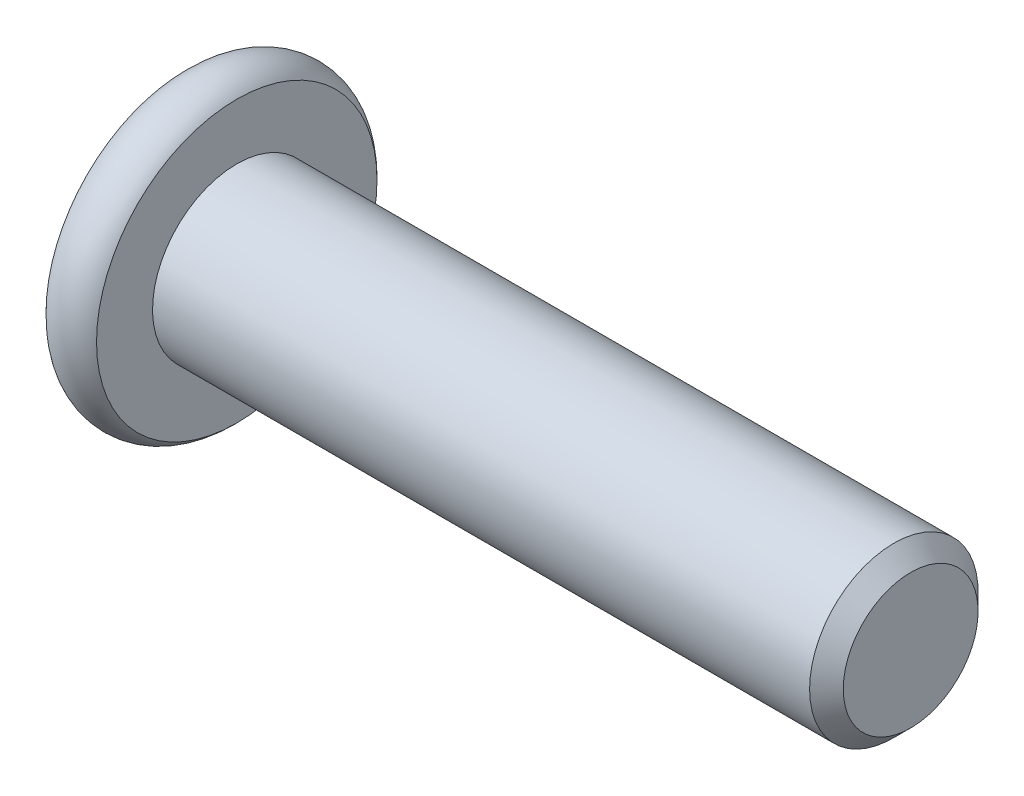
ISO-10303-21;
HEADER;
FILE_DESCRIPTION(('STEP AP214'),'2;1');
FILE_NAME('part.step','',(''),(''),'','','');
FILE_SCHEMA(('AUTOMOTIVE_DESIGN { 1 0 10303 214 1 1 1 1 }'));
ENDSEC;
DATA;
#1=APPLICATION_CONTEXT('core data for automotive mechanical design processes');
#2=APPLICATION_PROTOCOL_DEFINITION('international standard','automotive_design',2000,#1);
#3=PRODUCT_CONTEXT('',#1,'mechanical');
#4=PRODUCT('Part','Part','',(#3));
#5=PRODUCT_RELATED_PRODUCT_CATEGORY('part','',(#4));
#6=PRODUCT_DEFINITION_FORMATION('','',#4);
#7=PRODUCT_DEFINITION_CONTEXT('part definition',#1,'design');
#8=PRODUCT_DEFINITION('design','',#6,#7);
#9=PRODUCT_DEFINITION_SHAPE('','',#8);
#10=(LENGTH_UNIT() NAMED_UNIT(*) SI_UNIT(.MILLI.,.METRE.));
#11=(NAMED_UNIT(*) PLANE_ANGLE_UNIT() SI_UNIT($,.RADIAN.));
#12=(NAMED_UNIT(*) SI_UNIT($,.STERADIAN.) SOLID_ANGLE_UNIT());
#13=UNCERTAINTY_MEASURE_WITH_UNIT(LENGTH_MEASURE(1.E-05),#10,'distance_accuracy_value','');
#14=(GEOMETRIC_REPRESENTATION_CONTEXT(3) GLOBAL_UNCERTAINTY_ASSIGNED_CONTEXT((#13)) GLOBAL_UNIT_ASSIGNED_CONTEXT((#10,
#11,#12)) REPRESENTATION_CONTEXT('',''));
#15=CARTESIAN_POINT('',(0.,0.,0.));
#16=DIRECTION('',(0.,0.,1.));
#17=DIRECTION('',(1.,0.,0.));
#18=AXIS2_PLACEMENT_3D('',#15,#16,#17);
#19=CARTESIAN_POINT('',(-19.2,1.11022302462516E-13,2.22044604925031E-13));
#20=DIRECTION('',(-1.,0.,0.));
#21=DIRECTION('',(0.,-1.,0.));
#22=AXIS2_PLACEMENT_3D('',#19,#20,#21);
#23=PLANE('',#22);
#24=DIRECTION('',(0.,-0.5,-0.866025403784439));
#25=VECTOR('',#24,1.);
#26=CARTESIAN_POINT('',(-19.2,-1.732050807569,4.44089209850063E-13));
#27=LINE('',#26,#25);
#28=CARTESIAN_POINT('',(-19.2,-1.73205080756905,4.12227544476185E-13));
#29=VERTEX_POINT('',#28);
#30=CARTESIAN_POINT('',(-19.2,-0.866025403784579,1.50000000000029));
#31=VERTEX_POINT('',#30);
#32=EDGE_CURVE('E105',#29,#31,#27,.F.);
#33=ORIENTED_EDGE('',*,*,#32,.T.);
#34=DIRECTION('',(0.,-1.,0.));
#35=VECTOR('',#34,1.);
#36=CARTESIAN_POINT('',(-19.2,-0.866025403784554,1.50000000000028));
#37=LINE('',#36,#35);
#38=CARTESIAN_POINT('',(-19.2,0.866025403784387,1.5000000000002));
#39=VERTEX_POINT('',#38);
#40=EDGE_CURVE('E122',#31,#39,#37,.F.);
#41=ORIENTED_EDGE('',*,*,#40,.T.);
#42=DIRECTION('',(0.,-0.5,0.866025403784439));
#43=VECTOR('',#42,1.);
#44=CARTESIAN_POINT('',(-19.2,0.866025403784387,1.50000000000017));
#45=LINE('',#44,#43);
#46=CARTESIAN_POINT('',(-19.2,1.73205080756891,0.));
#47=VERTEX_POINT('',#46);
#48=EDGE_CURVE('E73',#39,#47,#45,.F.);
#49=ORIENTED_EDGE('',*,*,#48,.T.);
#50=DIRECTION('',(0.,0.5,0.866025403784439));
#51=VECTOR('',#50,1.);
#52=CARTESIAN_POINT('',(-19.2,1.73205080756889,0.));
#53=LINE('',#52,#51);
#54=CARTESIAN_POINT('',(-19.2,0.866025403784346,-1.50000000000017));
#55=VERTEX_POINT('',#54);
#56=EDGE_CURVE('E87',#47,#55,#53,.F.);
#57=ORIENTED_EDGE('',*,*,#56,.T.);
#58=DIRECTION('',(0.,1.,0.));
#59=VECTOR('',#58,1.);
#60=CARTESIAN_POINT('',(-19.2,0.866025403784332,-1.50000000000017));
#61=LINE('',#60,#59);
#62=CARTESIAN_POINT('',(-19.2,-0.866025403784554,-1.50000000000002));
#63=VERTEX_POINT('',#62);
#64=EDGE_CURVE('E89',#55,#63,#61,.F.);
#65=ORIENTED_EDGE('',*,*,#64,.T.);
#66=DIRECTION('',(0.,0.5,-0.866025403784439));
#67=VECTOR('',#66,1.);
#68=CARTESIAN_POINT('',(-19.2,-0.866025403784554,-1.49999999999995));
#69=LINE('',#68,#67);
#70=EDGE_CURVE('E98',#63,#29,#69,.F.);
#71=ORIENTED_EDGE('',*,*,#70,.T.);
#72=EDGE_LOOP('',(#33,#41,#49,#57,#65,#71));
#73=FACE_BOUND('',#72,.T.);
#74=ADVANCED_FACE('F16',(#73),#23,.T.);
#75=CARTESIAN_POINT('',(-19.2,0.866025403784332,-1.50000000000017));
#76=DIRECTION('',(0.,0.,-1.));
#77=DIRECTION('',(0.,1.,0.));
#78=AXIS2_PLACEMENT_3D('',#75,#76,#77);
#79=PLANE('',#78);
#80=CARTESIAN_POINT('',(-21.4499999646885,0.866025333005009,-1.50000000000348));
#81=CARTESIAN_POINT('',(-21.4202628181792,0.806493904918047,-1.50000000000136));
#82=CARTESIAN_POINT('',(-21.3922724728056,0.745967110481277,-1.50000000000049));
#83=CARTESIAN_POINT('',(-21.3410233456331,0.622546765476727,-1.49999999999985));
#84=CARTESIAN_POINT('',(-21.317793069509,0.559641484044933,-1.50000000000008));
#85=CARTESIAN_POINT('',(-21.2779994505405,0.432796069034418,-1.50000000000025));
#86=CARTESIAN_POINT('',(-21.2613361149431,0.368888221746386,-1.50000000000019));
#87=CARTESIAN_POINT('',(-21.2356630722141,0.239665989378908,-1.50000000000015));
#88=CARTESIAN_POINT('',(-21.226634208317,0.174355549007323,-1.50000000000016));
#89=CARTESIAN_POINT('',(-21.2184874102268,0.0617869427827018,-1.50000000000017));
#90=CARTESIAN_POINT('',(-21.2172818824174,0.0146740817378056,-1.50000000000017));
#91=CARTESIAN_POINT('',(-21.2193161388826,-0.0794684187308703,-1.50000000000017));
#92=CARTESIAN_POINT('',(-21.2225569051143,-0.126498037473702,-1.50000000000017));
#93=CARTESIAN_POINT('',(-21.2332973069677,-0.22010433346858,-1.50000000000017));
#94=CARTESIAN_POINT('',(-21.2408009028577,-0.266680548513968,-1.50000000000017));
#95=CARTESIAN_POINT('',(-21.2596594760416,-0.359051196505823,-1.50000000000017));
#96=CARTESIAN_POINT('',(-21.2710161059492,-0.404845285121393,-1.50000000000017));
#97=CARTESIAN_POINT('',(-21.3047185804914,-0.52209769377422,-1.50000000000017));
#98=CARTESIAN_POINT('',(-21.3296009771679,-0.592830026999191,-1.50000000000017));
#99=CARTESIAN_POINT('',(-21.3716037140561,-0.696834151520759,-1.50000000000017));
#100=CARTESIAN_POINT('',(-21.3863606345896,-0.731106739416639,-1.50000000000017));
#101=CARTESIAN_POINT('',(-21.4172215007328,-0.799021963429262,-1.50000000000017));
#102=CARTESIAN_POINT('',(-21.4333248053878,-0.832664890069435,-1.50000000000017));
#103=CARTESIAN_POINT('',(-21.4499999647041,-0.866025333032227,-1.50000000000017));
#104=B_SPLINE_CURVE_WITH_KNOTS('',3,(#80,#81,#82,#83,#84,#85,#86,#87,#88,#89,#90,#91,#92,#93,
#94,#95,#96,#97,#98,#99,#100,#101,#102,#103),.UNSPECIFIED.,.F.,.F.,(4,2,2,2,2,2,2,2,2,2,2,4),
(0.,0.199774403103241,0.400712278287902,0.598459940053955,0.795709919291978,0.93689462376089,
1.07811051367086,1.21945781148113,1.36086581168796,1.58533898614379,1.69726351134722,
1.8091350542896),.UNSPECIFIED.);
#105=CARTESIAN_POINT('',(-21.4500000036056,0.86602540025868,-1.50000000610682));
#106=VERTEX_POINT('',#105);
#107=CARTESIAN_POINT('',(-21.4499999823918,-0.866025368407813,-1.50000000000005));
#108=VERTEX_POINT('',#107);
#109=EDGE_CURVE('E19',#106,#108,#104,.T.);
#110=ORIENTED_EDGE('',*,*,#109,.T.);
#111=DIRECTION('',(1.,0.,0.));
#112=VECTOR('',#111,1.);
#113=CARTESIAN_POINT('',(-19.2,-0.866025403784554,-1.49999999999995));
#114=LINE('',#113,#112);
#115=EDGE_CURVE('E92',#108,#63,#114,.T.);
#116=ORIENTED_EDGE('',*,*,#115,.T.);
#117=ORIENTED_EDGE('',*,*,#64,.F.);
#118=DIRECTION('',(1.,0.,0.));
#119=VECTOR('',#118,1.);
#120=CARTESIAN_POINT('',(-19.2,0.866025403784346,-1.50000000000018));
#121=LINE('',#120,#119);
#122=EDGE_CURVE('E62',#55,#106,#121,.F.);
#123=ORIENTED_EDGE('',*,*,#122,.T.);
#124=EDGE_LOOP('',(#110,#116,#117,#123));
#125=FACE_BOUND('',#124,.T.);
#126=ADVANCED_FACE('F94',(#125),#79,.F.);
#127=CARTESIAN_POINT('',(-19.2,-0.866025403784554,-1.49999999999995));
#128=DIRECTION('',(0.,-0.866025403784439,-0.5));
#129=DIRECTION('',(0.,0.5,-0.866025403784439));
#130=AXIS2_PLACEMENT_3D('',#127,#128,#129);
#131=PLANE('',#130);
#132=CARTESIAN_POINT('',(-21.4500000205659,-0.866025373568964,-1.4999999911101));
#133=CARTESIAN_POINT('',(-21.4202628611323,-0.895791104607932,-1.44844427182069));
#134=CARTESIAN_POINT('',(-21.3922725080009,-0.92605451005725,-1.39602653208729));
#135=CARTESIAN_POINT('',(-21.3410233701714,-0.987764691357992,-1.28914137459533));
#136=CARTESIAN_POINT('',(-21.3177930911687,-1.01921733259522,-1.23466379757139));
#137=CARTESIAN_POINT('',(-21.2779994659171,-1.08264004325779,-1.12481243721317));
#138=CARTESIAN_POINT('',(-21.2613361268894,-1.11459396949522,-1.06946661461272));
#139=CARTESIAN_POINT('',(-21.2356630784661,-1.17920509052607,-0.957556871075898));
#140=CARTESIAN_POINT('',(-21.2266342123071,-1.21186031296697,-0.900996366357963));
#141=CARTESIAN_POINT('',(-21.2184874115618,-1.26814461833851,-0.803509089626276));
#142=CARTESIAN_POINT('',(-21.2172818827387,-1.29170104877942,-0.762708155306338));
#143=CARTESIAN_POINT('',(-21.2193161371708,-1.33877229887107,-0.681178358607479));
#144=CARTESIAN_POINT('',(-21.222556902382,-1.36228710818135,-0.640449514138743));
#145=CARTESIAN_POINT('',(-21.2332973022396,-1.40909025614153,-0.559384083907977));
#146=CARTESIAN_POINT('',(-21.2408008971605,-1.43237836368778,-0.519047898429233));
#147=CARTESIAN_POINT('',(-21.2596594685009,-1.47856368775851,-0.43905257057729));
#148=CARTESIAN_POINT('',(-21.2710160975342,-1.50146073211755,-0.399393726403392));
#149=CARTESIAN_POINT('',(-21.304718575203,-1.56008694571787,-0.297850145791179));
#150=CARTESIAN_POINT('',(-21.3296009780989,-1.59545312126237,-0.236594132879223));
#151=CARTESIAN_POINT('',(-21.3716037265078,-1.6474551963868,-0.146523896664901));
#152=CARTESIAN_POINT('',(-21.3863606512358,-1.6645914945245,-0.116842957636725));
#153=CARTESIAN_POINT('',(-21.4172215263397,-1.69854911474959,-0.0580266341026783));
#154=CARTESIAN_POINT('',(-21.4333248357597,-1.71537058209897,-0.0288909979956472));
#155=CARTESIAN_POINT('',(-21.4500000000594,-1.73205080754814,-3.60527799728126E-11));
#156=B_SPLINE_CURVE_WITH_KNOTS('',3,(#132,#133,#134,#135,#136,#137,#138,#139,#140,#141,#142,
#143,#144,#145,#146,#147,#148,#149,#150,#151,#152,#153,#154,#155),.UNSPECIFIED.,.F.,.F.,(4,2,2,
2,2,2,2,2,2,2,2,4),(0.,0.199774419630154,0.400712311126413,0.598459987770823,0.795709981982896,
0.936894685933899,1.07811057529518,1.21945787276772,1.36086587264047,1.58533910346246,
1.69726365672268,1.80913522763079),.UNSPECIFIED.);
#157=CARTESIAN_POINT('',(-21.4499999999911,-1.73205080753866,3.30321687967426E-13));
#158=VERTEX_POINT('',#157);
#159=EDGE_CURVE('E193',#108,#158,#156,.T.);
#160=ORIENTED_EDGE('',*,*,#159,.T.);
#161=DIRECTION('',(1.,0.,0.));
#162=VECTOR('',#161,1.);
#163=CARTESIAN_POINT('',(-19.2,-1.732050807569,4.44116400375182E-13));
#164=LINE('',#163,#162);
#165=EDGE_CURVE('E110',#158,#29,#164,.T.);
#166=ORIENTED_EDGE('',*,*,#165,.T.);
#167=ORIENTED_EDGE('',*,*,#70,.F.);
#168=ORIENTED_EDGE('',*,*,#115,.F.);
#169=EDGE_LOOP('',(#160,#166,#167,#168));
#170=FACE_BOUND('',#169,.T.);
#171=ADVANCED_FACE('F199',(#170),#131,.F.);
#172=CARTESIAN_POINT('',(-19.2,1.73205080756889,0.));
#173=DIRECTION('',(0.,0.866025403784439,-0.5));
#174=DIRECTION('',(0.,0.5,0.866025403784439));
#175=AXIS2_PLACEMENT_3D('',#172,#173,#174);
#176=PLANE('',#175);
#177=CARTESIAN_POINT('',(-21.4500000000603,1.73205080753914,-3.70697593604407E-11));
#178=CARTESIAN_POINT('',(-21.4202628496066,1.70228509136382,-0.0515557327856642));
#179=CARTESIAN_POINT('',(-21.3922725003558,1.67202169195343,-0.103973478178008));
#180=CARTESIAN_POINT('',(-21.3410233657898,1.61031151485385,-0.210858640261363));
#181=CARTESIAN_POINT('',(-21.3177930861585,1.57885887173032,-0.265336216182613));
#182=CARTESIAN_POINT('',(-21.2779994610234,1.51543615935823,-0.375187576364152));
#183=CARTESIAN_POINT('',(-21.261336122734,1.48348223326158,-0.430533399865125));
#184=CARTESIAN_POINT('',(-21.2356630756987,1.41887111201441,-0.542443144599422));
#185=CARTESIAN_POINT('',(-21.22663421018,1.38621588921876,-0.599003649613897));
#186=CARTESIAN_POINT('',(-21.2184874107391,1.32993158336417,-0.696490927022741));
#187=CARTESIAN_POINT('',(-21.2172818825308,1.30637515274063,-0.737291861707695));
#188=CARTESIAN_POINT('',(-21.219316138243,1.25930390228714,-0.818821659068949));
#189=CARTESIAN_POINT('',(-21.2225569041202,1.23578909279766,-0.859550503835035));
#190=CARTESIAN_POINT('',(-21.2332973053319,1.18898594453939,-0.94061593457253));
#191=CARTESIAN_POINT('',(-21.2408009009368,1.16569783687405,-0.980952120261031));
#192=CARTESIAN_POINT('',(-21.2596594736259,1.11951251258741,-1.06094744848954));
#193=CARTESIAN_POINT('',(-21.2710161033238,1.09661546813158,-1.10060629283021));
#194=CARTESIAN_POINT('',(-21.3047185820239,1.03798925540975,-1.20214987191976));
#195=CARTESIAN_POINT('',(-21.3296009849972,1.0026230808166,-1.26340588318445));
#196=CARTESIAN_POINT('',(-21.3716037331999,0.950621007047378,-1.35347611705168));
#197=CARTESIAN_POINT('',(-21.3863606578141,0.93348470934078,-1.38315705533313));
#198=CARTESIAN_POINT('',(-21.4172215326024,0.899527089960107,-1.44197337740455));
#199=CARTESIAN_POINT('',(-21.4333248418208,0.882705623024075,-1.47110901279559));
#200=CARTESIAN_POINT('',(-21.4500000058833,0.866025397981074,-1.50000001005175));
#201=B_SPLINE_CURVE_WITH_KNOTS('',3,(#177,#178,#179,#180,#181,#182,#183,#184,#185,#186,#187,
#188,#189,#190,#191,#192,#193,#194,#195,#196,#197,#198,#199,#200),.UNSPECIFIED.,.F.,.F.,(4,2,2,
2,2,2,2,2,2,2,2,4),(0.,0.199774419892707,0.400712312242308,0.5984599902201,0.795709985507776,
0.936894690613793,1.07811058115291,1.21945787966601,1.36086588058242,1.5853391061546,
1.69726365690588,1.80913522531795),.UNSPECIFIED.);
#202=CARTESIAN_POINT('',(-21.4500000000447,1.7320508075386,0.));
#203=VERTEX_POINT('',#202);
#204=EDGE_CURVE('E102',#203,#106,#201,.T.);
#205=ORIENTED_EDGE('',*,*,#204,.T.);
#206=ORIENTED_EDGE('',*,*,#122,.F.);
#207=ORIENTED_EDGE('',*,*,#56,.F.);
#208=DIRECTION('',(1.,0.,0.));
#209=VECTOR('',#208,1.);
#210=CARTESIAN_POINT('',(-19.2,1.73205080756891,0.));
#211=LINE('',#210,#209);
#212=EDGE_CURVE('E43',#47,#203,#211,.F.);
#213=ORIENTED_EDGE('',*,*,#212,.T.);
#214=EDGE_LOOP('',(#205,#206,#207,#213));
#215=FACE_BOUND('',#214,.T.);
#216=ADVANCED_FACE('F100',(#215),#176,.F.);
#217=CARTESIAN_POINT('',(-19.2,-1.732050807569,4.44089209850063E-13));
#218=DIRECTION('',(0.,-0.866025403784439,0.5));
#219=DIRECTION('',(0.,-0.5,-0.866025403784439));
#220=AXIS2_PLACEMENT_3D('',#217,#218,#219);
#221=PLANE('',#220);
#222=CARTESIAN_POINT('',(-21.4500000000593,-1.73205080754833,3.65670650555271E-11));
#223=CARTESIAN_POINT('',(-21.4202628496423,-1.70228509140311,0.0515557327235319));
#224=CARTESIAN_POINT('',(-21.3922725004231,-1.6720216920269,0.103973478052801));
#225=CARTESIAN_POINT('',(-21.3410233659059,-1.61031151500032,0.210858640006839));
#226=CARTESIAN_POINT('',(-21.3177930862918,-1.57885887191565,0.265336215861846));
#227=CARTESIAN_POINT('',(-21.2779994611265,-1.51543615954775,0.375187576036891));
#228=CARTESIAN_POINT('',(-21.2613361228043,-1.48348223341406,0.430533399601733));
#229=CARTESIAN_POINT('',(-21.2356630757205,-1.41887111209099,0.542443144467291));
#230=CARTESIAN_POINT('',(-21.2266342101859,-1.38621588925648,0.599003649549134));
#231=CARTESIAN_POINT('',(-21.2184874107375,-1.32993158334896,0.696490927049709));
#232=CARTESIAN_POINT('',(-21.21728188253,-1.3063751527116,0.737291861758592));
#233=CARTESIAN_POINT('',(-21.2193161382487,-1.2593039022304,0.818821659167839));
#234=CARTESIAN_POINT('',(-21.2225569041319,-1.23578909272702,0.859550503957987));
#235=CARTESIAN_POINT('',(-21.2332973053539,-1.18898594446873,0.940615934695531));
#236=CARTESIAN_POINT('',(-21.2408009009582,-1.16569783681697,0.980952120360514));
#237=CARTESIAN_POINT('',(-21.2596594736414,-1.1195125125574,1.06094744854212));
#238=CARTESIAN_POINT('',(-21.2710161033338,-1.09661546811505,1.10060629285945));
#239=CARTESIAN_POINT('',(-21.3047185777738,-1.03798926280439,1.20214985911248));
#240=CARTESIAN_POINT('',(-21.3296009747641,-1.00262309536351,1.26340585798906));
#241=CARTESIAN_POINT('',(-21.3716037123773,-0.950621031890471,1.35347607402279));
#242=CARTESIAN_POINT('',(-21.3863606332032,-0.933484737535388,1.38315700649925));
#243=CARTESIAN_POINT('',(-21.4172214999976,-0.89952712473064,1.44197331718082));
#244=CARTESIAN_POINT('',(-21.4333248050113,-0.882705661019233,1.47110894698666));
#245=CARTESIAN_POINT('',(-21.4499999647122,-0.866025439152865,1.49999993874073));
#246=B_SPLINE_CURVE_WITH_KNOTS('',3,(#222,#223,#224,#225,#226,#227,#228,#229,#230,#231,#232,
#233,#234,#235,#236,#237,#238,#239,#240,#241,#242,#243,#244,#245),.UNSPECIFIED.,.F.,.F.,(4,2,2,
2,2,2,2,2,2,2,2,4),(0.,0.199774419659113,0.400712311775826,0.598459989991556,0.795709985514906,
0.936894690703464,1.07811058132635,1.21945787975995,1.36086588059107,1.58533906000743,
1.69726358780022,1.80913513332332),.UNSPECIFIED.);
#247=CARTESIAN_POINT('',(-21.4499999823961,-0.866025421468877,1.49999996937021));
#248=VERTEX_POINT('',#247);
#249=EDGE_CURVE('E267',#158,#248,#246,.T.);
#250=ORIENTED_EDGE('',*,*,#249,.T.);
#251=DIRECTION('',(1.,0.,0.));
#252=VECTOR('',#251,1.);
#253=CARTESIAN_POINT('',(-19.2,-0.866025403784554,1.50000000000028));
#254=LINE('',#253,#252);
#255=EDGE_CURVE('E125',#248,#31,#254,.T.);
#256=ORIENTED_EDGE('',*,*,#255,.T.);
#257=ORIENTED_EDGE('',*,*,#32,.F.);
#258=ORIENTED_EDGE('',*,*,#165,.F.);
#259=EDGE_LOOP('',(#250,#256,#257,#258));
#260=FACE_BOUND('',#259,.T.);
#261=ADVANCED_FACE('F261',(#260),#221,.F.);
#262=CARTESIAN_POINT('',(-19.2,-0.866025403784554,1.50000000000028));
#263=DIRECTION('',(0.,0.,1.));
#264=DIRECTION('',(0.,-1.,0.));
#265=AXIS2_PLACEMENT_3D('',#262,#263,#264);
#266=PLANE('',#265);
#267=CARTESIAN_POINT('',(-21.4500000205553,-0.866025411178203,1.49999996939382));
#268=CARTESIAN_POINT('',(-21.4202628611542,-0.806493983103668,1.49999998898728));
#269=CARTESIAN_POINT('',(-21.3922725080508,-0.745967186223708,1.49999999704316));
#270=CARTESIAN_POINT('',(-21.3410233702652,-0.622546834027802,1.50000000297462));
#271=CARTESIAN_POINT('',(-21.3177930912783,-0.559641547837078,1.50000000079063));
#272=CARTESIAN_POINT('',(-21.2779994660023,-0.432796123804603,1.49999999922248));
#273=CARTESIAN_POINT('',(-21.2613361269473,-0.368888272258535,1.49999999979441));
#274=CARTESIAN_POINT('',(-21.2356630784834,-0.239666030781878,1.50000000020563));
#275=CARTESIAN_POINT('',(-21.2266342123112,-0.174355585559518,1.50000000004674));
#276=CARTESIAN_POINT('',(-21.2184874115599,-0.0617869745889716,1.49999999996702));
#277=CARTESIAN_POINT('',(-21.2172818827375,-0.0146741137256615,1.49999999999137));
#278=CARTESIAN_POINT('',(-21.2193161371755,0.079468386474166,1.50000000000919));
#279=CARTESIAN_POINT('',(-21.2225569023919,0.126498005129778,1.50000000000267));
#280=CARTESIAN_POINT('',(-21.2332973022584,0.220104301058296,1.49999999999788));
#281=CARTESIAN_POINT('',(-21.2408008971788,0.266680516124372,1.49999999999963));
#282=CARTESIAN_POINT('',(-21.2596594685143,0.359051164216919,1.50000000000093));
#283=CARTESIAN_POINT('',(-21.271016097543,0.404845252912526,1.50000000000049));
#284=CARTESIAN_POINT('',(-21.3047185715542,0.522097667387475,1.49999999999995));
#285=CARTESIAN_POINT('',(-21.3296009693131,0.592830006194069,1.50000000000021));
#286=CARTESIAN_POINT('',(-21.3716037086299,0.696834138762038,1.50000000000031));
#287=CARTESIAN_POINT('',(-21.3863606301052,0.731106729282198,1.5000000000003));
#288=CARTESIAN_POINT('',(-21.4172214983456,0.799021958440166,1.50000000000026));
#289=CARTESIAN_POINT('',(-21.4333248041555,0.8326648876016,1.50000000000025));
#290=CARTESIAN_POINT('',(-21.4499999647103,0.86602533304492,1.50000000000028));
#291=B_SPLINE_CURVE_WITH_KNOTS('',3,(#267,#268,#269,#270,#271,#272,#273,#274,#275,#276,#277,
#278,#279,#280,#281,#282,#283,#284,#285,#286,#287,#288,#289,#290),.UNSPECIFIED.,.F.,.F.,(4,2,2,
2,2,2,2,2,2,2,2,4),(0.,0.199774419425052,0.400712310716702,0.598459987560867,0.795709981970799,
0.936894685992416,1.07811057542538,1.21945787282943,1.36086587262872,1.58533906382119,
1.69726359736914,1.80913514862467),.UNSPECIFIED.);
#292=CARTESIAN_POINT('',(-21.449999982395,0.866025368414274,1.50000000000023));
#293=VERTEX_POINT('',#292);
#294=EDGE_CURVE('E168',#248,#293,#291,.T.);
#295=ORIENTED_EDGE('',*,*,#294,.T.);
#296=DIRECTION('',(1.,0.,0.));
#297=VECTOR('',#296,1.);
#298=CARTESIAN_POINT('',(-19.2,0.866025403784387,1.50000000000017));
#299=LINE('',#298,#297);
#300=EDGE_CURVE('E237',#293,#39,#299,.T.);
#301=ORIENTED_EDGE('',*,*,#300,.T.);
#302=ORIENTED_EDGE('',*,*,#40,.F.);
#303=ORIENTED_EDGE('',*,*,#255,.F.);
#304=EDGE_LOOP('',(#295,#301,#302,#303));
#305=FACE_BOUND('',#304,.T.);
#306=ADVANCED_FACE('F270',(#305),#266,.F.);
#307=CARTESIAN_POINT('',(-19.2,0.866025403784387,1.50000000000017));
#308=DIRECTION('',(0.,0.866025403784439,0.5));
#309=DIRECTION('',(0.,-0.5,0.866025403784439));
#310=AXIS2_PLACEMENT_3D('',#307,#308,#309);
#311=PLANE('',#310);
#312=CARTESIAN_POINT('',(-21.4500000205571,0.866025373579021,1.49999999110218));
#313=CARTESIAN_POINT('',(-21.4202628611256,0.895791104615358,1.44844427181122));
#314=CARTESIAN_POINT('',(-21.3922725079953,0.926054510063411,1.39602653207751));
#315=CARTESIAN_POINT('',(-21.3410233701674,0.987764691362816,1.28914137458601));
#316=CARTESIAN_POINT('',(-21.3177930911652,1.01921733259998,1.23466379756286));
#317=CARTESIAN_POINT('',(-21.2779994659144,1.08264004326209,1.12481243720593));
#318=CARTESIAN_POINT('',(-21.2613361268873,1.11459396949913,1.06946661460598));
#319=CARTESIAN_POINT('',(-21.2356630784648,1.17920509052925,0.957556871070286));
#320=CARTESIAN_POINT('',(-21.2266342123061,1.21186031296981,0.900996366352985));
#321=CARTESIAN_POINT('',(-21.2184874115613,1.26814461834101,0.803509089621915));
#322=CARTESIAN_POINT('',(-21.2172818827384,1.29170104878193,0.762708155301956));
#323=CARTESIAN_POINT('',(-21.2193161371707,1.33877229887359,0.681178358603069));
#324=CARTESIAN_POINT('',(-21.2225569023821,1.36228710818387,0.640449514134327));
#325=CARTESIAN_POINT('',(-21.23329730224,1.40909025614405,0.559384083903565));
#326=CARTESIAN_POINT('',(-21.240800897161,1.43237836369029,0.519047898424831));
#327=CARTESIAN_POINT('',(-21.2596594685017,1.47856368776101,0.439052570572917));
#328=CARTESIAN_POINT('',(-21.2710160975352,1.50146073212004,0.399393726399036));
#329=CARTESIAN_POINT('',(-21.3047185752038,1.56008694571951,0.297850145788298));
#330=CARTESIAN_POINT('',(-21.3296009780992,1.5954531212632,0.236594132877755));
#331=CARTESIAN_POINT('',(-21.3716037265072,1.64745519638645,0.146523896665466));
#332=CARTESIAN_POINT('',(-21.3863606512348,1.66459149452377,0.116842957637953));
#333=CARTESIAN_POINT('',(-21.4172215263379,1.6985491147481,0.0580266341052046));
#334=CARTESIAN_POINT('',(-21.4333248357576,1.71537058209712,0.0288909979988102));
#335=CARTESIAN_POINT('',(-21.4500000000568,1.73205080754593,3.98432693609915E-11));
#336=B_SPLINE_CURVE_WITH_KNOTS('',3,(#312,#313,#314,#315,#316,#317,#318,#319,#320,#321,#322,
#323,#324,#325,#326,#327,#328,#329,#330,#331,#332,#333,#334,#335),.UNSPECIFIED.,.F.,.F.,(4,2,2,
2,2,2,2,2,2,2,2,4),(0.,0.199774419627709,0.400712311121558,0.598459987763738,0.795709981973567,
0.936894685924621,1.07811057528596,1.21945787275854,1.36086587263132,1.58533910344825,
1.69726365670594,1.80913522761154),.UNSPECIFIED.);
#337=EDGE_CURVE('E161',#293,#203,#336,.T.);
#338=ORIENTED_EDGE('',*,*,#337,.T.);
#339=ORIENTED_EDGE('',*,*,#212,.F.);
#340=ORIENTED_EDGE('',*,*,#48,.F.);
#341=ORIENTED_EDGE('',*,*,#300,.F.);
#342=EDGE_LOOP('',(#338,#339,#340,#341));
#343=FACE_BOUND('',#342,.T.);
#344=ADVANCED_FACE('F174',(#343),#311,.F.);
#345=CARTESIAN_POINT('',(-21.5000000001169,1.66533453693773E-13,0.));
#346=DIRECTION('',(-1.,0.,0.));
#347=DIRECTION('',(0.,-1.,0.));
#348=AXIS2_PLACEMENT_3D('',#345,#346,#347);
#349=CONICAL_SURFACE('',#348,1.7820508076058,0.78539816339745);
#350=ORIENTED_EDGE('',*,*,#249,.F.);
#351=ORIENTED_EDGE('',*,*,#159,.F.);
#352=ORIENTED_EDGE('',*,*,#109,.F.);
#353=ORIENTED_EDGE('',*,*,#204,.F.);
#354=ORIENTED_EDGE('',*,*,#337,.F.);
#355=ORIENTED_EDGE('',*,*,#294,.F.);
#356=EDGE_LOOP('',(#350,#351,#352,#353,#354,#355));
#357=FACE_BOUND('',#356,.T.);
#358=CARTESIAN_POINT('',(-21.4999999999462,1.66533453693109E-13,0.));
#359=DIRECTION('',(-1.,0.,0.));
#360=DIRECTION('',(0.,-1.,0.));
#361=AXIS2_PLACEMENT_3D('',#358,#359,#360);
#362=CIRCLE('',#361,1.7820508074351);
#363=CARTESIAN_POINT('',(-21.4999999999462,-1.78205080743493,0.));
#364=VERTEX_POINT('',#363);
#365=EDGE_CURVE('E157',#364,#364,#362,.T.);
#366=ORIENTED_EDGE('',*,*,#365,.T.);
#367=EDGE_LOOP('',(#366));
#368=FACE_BOUND('',#367,.T.);
#369=ADVANCED_FACE('F176',(#357,#368),#349,.F.);
#370=CARTESIAN_POINT('',(-21.5,0.,2.22044604925031E-13));
#371=DIRECTION('',(1.,0.,0.));
#372=DIRECTION('',(0.,1.,0.));
#373=AXIS2_PLACEMENT_3D('',#370,#371,#372);
#374=PLANE('',#373);
#375=CARTESIAN_POINT('',(-21.5,0.,2.22044604925031E-13));
#376=DIRECTION('',(-1.,0.,0.));
#377=DIRECTION('',(0.,-1.,0.));
#378=AXIS2_PLACEMENT_3D('',#375,#376,#377);
#379=CIRCLE('',#378,4.16143782776624);
#380=CARTESIAN_POINT('',(-21.5,-4.16143782776629,2.22044604925031E-13));
#381=VERTEX_POINT('',#380);
#382=EDGE_CURVE('E153',#381,#381,#379,.F.);
#383=ORIENTED_EDGE('',*,*,#382,.F.);
#384=EDGE_LOOP('',(#383));
#385=FACE_BOUND('',#384,.T.);
#386=ORIENTED_EDGE('',*,*,#365,.F.);
#387=EDGE_LOOP('',(#386));
#388=FACE_BOUND('',#387,.T.);
#389=ADVANCED_FACE('F180',(#385,#388),#374,.F.);
#390=CARTESIAN_POINT('',(-20.75,0.,2.22044604925031E-13));
#391=DIRECTION('',(-1.,0.,0.));
#392=DIRECTION('',(0.,-1.,0.));
#393=AXIS2_PLACEMENT_3D('',#390,#391,#392);
#394=TOROIDAL_SURFACE('',#393,3.5,1.);
#395=ORIENTED_EDGE('',*,*,#382,.T.);
#396=EDGE_LOOP('',(#395));
#397=FACE_BOUND('',#396,.T.);
#398=CARTESIAN_POINT('',(-20.,0.,2.22044604925031E-13));
#399=DIRECTION('',(-1.,0.,0.));
#400=DIRECTION('',(0.,-1.,0.));
#401=AXIS2_PLACEMENT_3D('',#398,#399,#400);
#402=CIRCLE('',#401,4.16143782776612);
#403=CARTESIAN_POINT('',(-20.,-4.16143782776617,2.22044604925031E-13));
#404=VERTEX_POINT('',#403);
#405=EDGE_CURVE('E149',#404,#404,#402,.T.);
#406=ORIENTED_EDGE('',*,*,#405,.T.);
#407=EDGE_LOOP('',(#406));
#408=FACE_BOUND('',#407,.T.);
#409=ADVANCED_FACE('F230',(#397,#408),#394,.T.);
#410=CARTESIAN_POINT('',(0.,0.,0.));
#411=DIRECTION('',(1.,0.,0.));
#412=DIRECTION('',(0.,1.,0.));
#413=AXIS2_PLACEMENT_3D('',#410,#411,#412);
#414=PLANE('',#413);
#415=CARTESIAN_POINT('',(0.,0.,0.));
#416=DIRECTION('',(-1.,0.,0.));
#417=DIRECTION('',(0.,0.,1.));
#418=AXIS2_PLACEMENT_3D('',#415,#416,#417);
#419=CIRCLE('',#418,2.00000000000955);
#420=CARTESIAN_POINT('',(0.,0.,2.00000000000955));
#421=VERTEX_POINT('',#420);
#422=EDGE_CURVE('E145',#421,#421,#419,.T.);
#423=ORIENTED_EDGE('',*,*,#422,.F.);
#424=EDGE_LOOP('',(#423));
#425=FACE_BOUND('',#424,.T.);
#426=ADVANCED_FACE('F228',(#425),#414,.T.);
#427=CARTESIAN_POINT('',(-20.,4.16143782776629,2.22044604925031E-13));
#428=DIRECTION('',(-1.,0.,0.));
#429=DIRECTION('',(0.,-1.,0.));
#430=AXIS2_PLACEMENT_3D('',#427,#428,#429);
#431=PLANE('',#430);
#432=ORIENTED_EDGE('',*,*,#405,.F.);
#433=EDGE_LOOP('',(#432));
#434=FACE_BOUND('',#433,.T.);
#435=CARTESIAN_POINT('',(-20.,0.,2.22044604925031E-13));
#436=DIRECTION('',(1.,0.,0.));
#437=DIRECTION('',(0.,1.,0.));
#438=AXIS2_PLACEMENT_3D('',#435,#436,#437);
#439=CIRCLE('',#438,2.5);
#440=CARTESIAN_POINT('',(-20.,2.49999999999994,2.22044604925031E-13));
#441=VERTEX_POINT('',#440);
#442=EDGE_CURVE('E30',#441,#441,#439,.T.);
#443=ORIENTED_EDGE('',*,*,#442,.F.);
#444=EDGE_LOOP('',(#443));
#445=FACE_BOUND('',#444,.T.);
#446=ADVANCED_FACE('F221',(#434,#445),#431,.F.);
#447=CARTESIAN_POINT('',(-0.499999999988177,0.,0.));
#448=DIRECTION('',(-1.,0.,0.));
#449=DIRECTION('',(0.,0.,1.));
#450=AXIS2_PLACEMENT_3D('',#447,#448,#449);
#451=CONICAL_SURFACE('',#450,2.49999999999773,0.785398163397448);
#452=CARTESIAN_POINT('',(-0.500000000000056,0.,2.22044604925031E-13));
#453=DIRECTION('',(1.,0.,0.));
#454=DIRECTION('',(0.,1.,0.));
#455=AXIS2_PLACEMENT_3D('',#452,#453,#454);
#456=CIRCLE('',#455,2.5);
#457=CARTESIAN_POINT('',(-0.500000000000056,2.49999999999994,2.22044604925031E-13));
#458=VERTEX_POINT('',#457);
#459=EDGE_CURVE('E11',#458,#458,#456,.F.);
#460=ORIENTED_EDGE('',*,*,#459,.F.);
#461=EDGE_LOOP('',(#460));
#462=FACE_BOUND('',#461,.T.);
#463=ORIENTED_EDGE('',*,*,#422,.T.);
#464=EDGE_LOOP('',(#463));
#465=FACE_BOUND('',#464,.T.);
#466=ADVANCED_FACE('F214',(#462,#465),#451,.T.);
#467=CARTESIAN_POINT('',(-20.,0.,2.22044604925031E-13));
#468=DIRECTION('',(1.,0.,0.));
#469=DIRECTION('',(0.,1.,0.));
#470=AXIS2_PLACEMENT_3D('',#467,#468,#469);
#471=CYLINDRICAL_SURFACE('',#470,2.5);
#472=ORIENTED_EDGE('',*,*,#442,.T.);
#473=EDGE_LOOP('',(#472));
#474=FACE_BOUND('',#473,.T.);
#475=ORIENTED_EDGE('',*,*,#459,.T.);
#476=EDGE_LOOP('',(#475));
#477=FACE_BOUND('',#476,.T.);
#478=ADVANCED_FACE('F212',(#474,#477),#471,.T.);
#479=CLOSED_SHELL('',(#74,#126,#171,#216,#261,#306,#344,#369,#389,#409,#426,#446,#466,#478));
#480=MANIFOLD_SOLID_BREP('B1',#479);
#481=ADVANCED_BREP_SHAPE_REPRESENTATION('',(#18,#480),#14);
#482=SHAPE_DEFINITION_REPRESENTATION(#9,#481);
ENDSEC;
END-ISO-10303-21;
